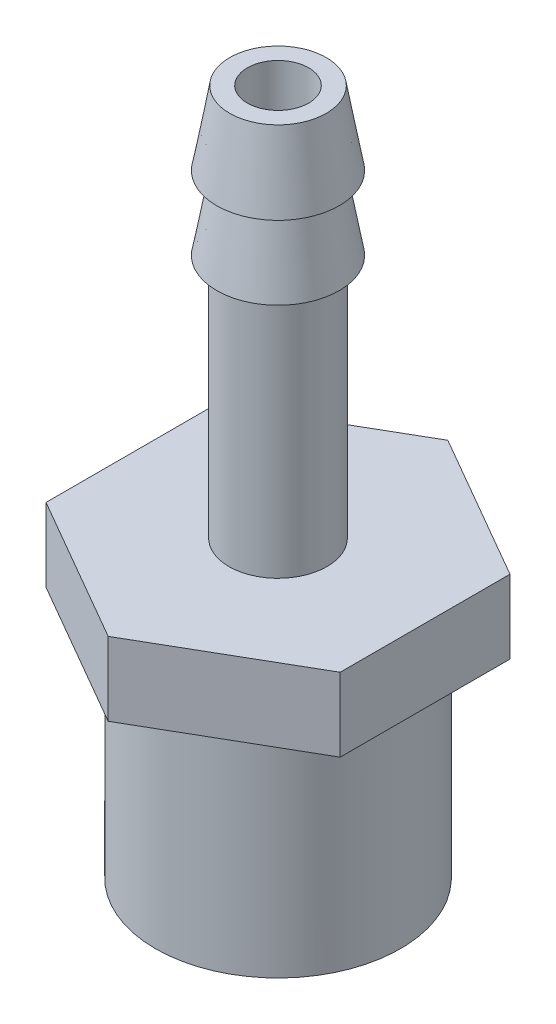
ISO-10303-21;
HEADER;
FILE_DESCRIPTION(('STEP AP214'),'2;1');
FILE_NAME('part.step','',(''),(''),'','','');
FILE_SCHEMA(('AUTOMOTIVE_DESIGN { 1 0 10303 214 1 1 1 1 }'));
ENDSEC;
DATA;
#1=APPLICATION_CONTEXT('core data for automotive mechanical design processes');
#2=APPLICATION_PROTOCOL_DEFINITION('international standard','automotive_design',2000,#1);
#3=PRODUCT_CONTEXT('',#1,'mechanical');
#4=PRODUCT('Part','Part','',(#3));
#5=PRODUCT_RELATED_PRODUCT_CATEGORY('part','',(#4));
#6=PRODUCT_DEFINITION_FORMATION('','',#4);
#7=PRODUCT_DEFINITION_CONTEXT('part definition',#1,'design');
#8=PRODUCT_DEFINITION('design','',#6,#7);
#9=PRODUCT_DEFINITION_SHAPE('','',#8);
#10=(LENGTH_UNIT() NAMED_UNIT(*) SI_UNIT(.MILLI.,.METRE.));
#11=(NAMED_UNIT(*) PLANE_ANGLE_UNIT() SI_UNIT($,.RADIAN.));
#12=(NAMED_UNIT(*) SI_UNIT($,.STERADIAN.) SOLID_ANGLE_UNIT());
#13=UNCERTAINTY_MEASURE_WITH_UNIT(LENGTH_MEASURE(1.E-05),#10,'distance_accuracy_value','');
#14=(GEOMETRIC_REPRESENTATION_CONTEXT(3) GLOBAL_UNCERTAINTY_ASSIGNED_CONTEXT((#13)) GLOBAL_UNIT_ASSIGNED_CONTEXT((#10,
#11,#12)) REPRESENTATION_CONTEXT('',''));
#15=CARTESIAN_POINT('',(0.,0.,0.));
#16=DIRECTION('',(0.,0.,1.));
#17=DIRECTION('',(1.,0.,0.));
#18=AXIS2_PLACEMENT_3D('',#15,#16,#17);
#19=CARTESIAN_POINT('',(0.,3.,-6.92820323027551));
#20=DIRECTION('',(0.,1.,0.));
#21=DIRECTION('',(0.,0.,1.));
#22=AXIS2_PLACEMENT_3D('',#19,#20,#21);
#23=PLANE('',#22);
#24=DIRECTION('',(-0.866025403784439,0.,-0.5));
#25=VECTOR('',#24,1.);
#26=CARTESIAN_POINT('',(6.,3.,-3.46410161513776));
#27=LINE('',#26,#25);
#28=CARTESIAN_POINT('',(6.,3.,-3.46410161513776));
#29=VERTEX_POINT('',#28);
#30=CARTESIAN_POINT('',(0.,3.,-6.92820323027551));
#31=VERTEX_POINT('',#30);
#32=EDGE_CURVE('E128',#29,#31,#27,.T.);
#33=ORIENTED_EDGE('',*,*,#32,.T.);
#34=DIRECTION('',(-0.866025403784438,0.,0.5));
#35=VECTOR('',#34,1.);
#36=CARTESIAN_POINT('',(0.,3.,-6.92820323027551));
#37=LINE('',#36,#35);
#38=CARTESIAN_POINT('',(-6.00000000000001,3.,-3.46410161513775));
#39=VERTEX_POINT('',#38);
#40=EDGE_CURVE('E86',#31,#39,#37,.T.);
#41=ORIENTED_EDGE('',*,*,#40,.T.);
#42=DIRECTION('',(0.,0.,1.));
#43=VECTOR('',#42,1.);
#44=CARTESIAN_POINT('',(-6.00000000000001,3.,-3.46410161513775));
#45=LINE('',#44,#43);
#46=CARTESIAN_POINT('',(-6.00000000000001,3.,3.46410161513776));
#47=VERTEX_POINT('',#46);
#48=EDGE_CURVE('E99',#39,#47,#45,.T.);
#49=ORIENTED_EDGE('',*,*,#48,.T.);
#50=DIRECTION('',(0.866025403784438,0.,0.5));
#51=VECTOR('',#50,1.);
#52=CARTESIAN_POINT('',(-6.00000000000001,3.,3.46410161513776));
#53=LINE('',#52,#51);
#54=CARTESIAN_POINT('',(0.,3.,6.92820323027551));
#55=VERTEX_POINT('',#54);
#56=EDGE_CURVE('E93',#47,#55,#53,.T.);
#57=ORIENTED_EDGE('',*,*,#56,.T.);
#58=DIRECTION('',(0.866025403784439,0.,-0.5));
#59=VECTOR('',#58,1.);
#60=CARTESIAN_POINT('',(0.,3.,6.92820323027551));
#61=LINE('',#60,#59);
#62=CARTESIAN_POINT('',(5.99999999999999,3.,3.46410161513776));
#63=VERTEX_POINT('',#62);
#64=EDGE_CURVE('E97',#55,#63,#61,.T.);
#65=ORIENTED_EDGE('',*,*,#64,.T.);
#66=DIRECTION('',(0.,0.,-1.));
#67=VECTOR('',#66,1.);
#68=CARTESIAN_POINT('',(5.99999999999999,3.,3.46410161513776));
#69=LINE('',#68,#67);
#70=EDGE_CURVE('E48',#63,#29,#69,.T.);
#71=ORIENTED_EDGE('',*,*,#70,.T.);
#72=EDGE_LOOP('',(#33,#41,#49,#57,#65,#71));
#73=FACE_BOUND('',#72,.T.);
#74=CARTESIAN_POINT('',(0.,3.,0.));
#75=DIRECTION('',(0.,1.,0.));
#76=DIRECTION('',(0.,0.,1.));
#77=AXIS2_PLACEMENT_3D('',#74,#75,#76);
#78=CIRCLE('',#77,2.);
#79=CARTESIAN_POINT('',(0.,3.,2.));
#80=VERTEX_POINT('',#79);
#81=EDGE_CURVE('E213',#80,#80,#78,.T.);
#82=ORIENTED_EDGE('',*,*,#81,.F.);
#83=EDGE_LOOP('',(#82));
#84=FACE_BOUND('',#83,.T.);
#85=ADVANCED_FACE('F31',(#73,#84),#23,.T.);
#86=CARTESIAN_POINT('',(0.,0.,-6.92820323027551));
#87=DIRECTION('',(0.,1.,0.));
#88=DIRECTION('',(0.,0.,1.));
#89=AXIS2_PLACEMENT_3D('',#86,#87,#88);
#90=PLANE('',#89);
#91=DIRECTION('',(-0.866025403784439,0.,-0.5));
#92=VECTOR('',#91,1.);
#93=CARTESIAN_POINT('',(6.,0.,-3.46410161513776));
#94=LINE('',#93,#92);
#95=CARTESIAN_POINT('',(6.,0.,-3.46410161513776));
#96=VERTEX_POINT('',#95);
#97=CARTESIAN_POINT('',(0.,0.,-6.92820323027551));
#98=VERTEX_POINT('',#97);
#99=EDGE_CURVE('E117',#96,#98,#94,.T.);
#100=ORIENTED_EDGE('',*,*,#99,.F.);
#101=DIRECTION('',(0.,0.,-1.));
#102=VECTOR('',#101,1.);
#103=CARTESIAN_POINT('',(5.99999999999999,0.,3.46410161513776));
#104=LINE('',#103,#102);
#105=CARTESIAN_POINT('',(5.99999999999999,0.,3.46410161513776));
#106=VERTEX_POINT('',#105);
#107=EDGE_CURVE('E77',#106,#96,#104,.T.);
#108=ORIENTED_EDGE('',*,*,#107,.F.);
#109=DIRECTION('',(0.866025403784439,0.,-0.5));
#110=VECTOR('',#109,1.);
#111=CARTESIAN_POINT('',(0.,0.,6.92820323027551));
#112=LINE('',#111,#110);
#113=CARTESIAN_POINT('',(0.,0.,6.92820323027551));
#114=VERTEX_POINT('',#113);
#115=EDGE_CURVE('E71',#114,#106,#112,.T.);
#116=ORIENTED_EDGE('',*,*,#115,.F.);
#117=DIRECTION('',(0.866025403784438,0.,0.5));
#118=VECTOR('',#117,1.);
#119=CARTESIAN_POINT('',(-6.00000000000001,0.,3.46410161513776));
#120=LINE('',#119,#118);
#121=CARTESIAN_POINT('',(-6.00000000000001,0.,3.46410161513776));
#122=VERTEX_POINT('',#121);
#123=EDGE_CURVE('E107',#122,#114,#120,.T.);
#124=ORIENTED_EDGE('',*,*,#123,.F.);
#125=DIRECTION('',(0.,0.,1.));
#126=VECTOR('',#125,1.);
#127=CARTESIAN_POINT('',(-6.00000000000001,0.,-3.46410161513775));
#128=LINE('',#127,#126);
#129=CARTESIAN_POINT('',(-6.00000000000001,0.,-3.46410161513775));
#130=VERTEX_POINT('',#129);
#131=EDGE_CURVE('E123',#130,#122,#128,.T.);
#132=ORIENTED_EDGE('',*,*,#131,.F.);
#133=DIRECTION('',(-0.866025403784438,0.,0.5));
#134=VECTOR('',#133,1.);
#135=CARTESIAN_POINT('',(0.,0.,-6.92820323027551));
#136=LINE('',#135,#134);
#137=EDGE_CURVE('E120',#98,#130,#136,.T.);
#138=ORIENTED_EDGE('',*,*,#137,.F.);
#139=EDGE_LOOP('',(#100,#108,#116,#124,#132,#138));
#140=FACE_BOUND('',#139,.T.);
#141=CARTESIAN_POINT('',(0.,0.,0.));
#142=DIRECTION('',(0.,1.,0.));
#143=DIRECTION('',(0.,0.,1.));
#144=AXIS2_PLACEMENT_3D('',#141,#142,#143);
#145=CIRCLE('',#144,5.);
#146=CARTESIAN_POINT('',(0.,0.,5.));
#147=VERTEX_POINT('',#146);
#148=EDGE_CURVE('E137',#147,#147,#145,.F.);
#149=ORIENTED_EDGE('',*,*,#148,.F.);
#150=EDGE_LOOP('',(#149));
#151=FACE_BOUND('',#150,.T.);
#152=ADVANCED_FACE('F162',(#140,#151),#90,.F.);
#153=CARTESIAN_POINT('',(6.,3.,-3.46410161513776));
#154=DIRECTION('',(-0.5,0.,0.866025403784438));
#155=DIRECTION('',(0.866025403784439,0.,0.5));
#156=AXIS2_PLACEMENT_3D('',#153,#154,#155);
#157=PLANE('',#156);
#158=ORIENTED_EDGE('',*,*,#99,.T.);
#159=DIRECTION('',(0.,-1.,0.));
#160=VECTOR('',#159,1.);
#161=CARTESIAN_POINT('',(0.,3.,-6.92820323027551));
#162=LINE('',#161,#160);
#163=EDGE_CURVE('E135',#31,#98,#162,.T.);
#164=ORIENTED_EDGE('',*,*,#163,.F.);
#165=ORIENTED_EDGE('',*,*,#32,.F.);
#166=DIRECTION('',(0.,-1.,0.));
#167=VECTOR('',#166,1.);
#168=CARTESIAN_POINT('',(6.,3.,-3.46410161513776));
#169=LINE('',#168,#167);
#170=EDGE_CURVE('E113',#29,#96,#169,.T.);
#171=ORIENTED_EDGE('',*,*,#170,.T.);
#172=EDGE_LOOP('',(#158,#164,#165,#171));
#173=FACE_BOUND('',#172,.T.);
#174=ADVANCED_FACE('F167',(#173),#157,.F.);
#175=CARTESIAN_POINT('',(0.,3.,-6.92820323027551));
#176=DIRECTION('',(0.5,0.,0.866025403784439));
#177=DIRECTION('',(0.866025403784439,0.,-0.5));
#178=AXIS2_PLACEMENT_3D('',#175,#176,#177);
#179=PLANE('',#178);
#180=ORIENTED_EDGE('',*,*,#137,.T.);
#181=DIRECTION('',(0.,-1.,0.));
#182=VECTOR('',#181,1.);
#183=CARTESIAN_POINT('',(-6.00000000000001,3.,-3.46410161513775));
#184=LINE('',#183,#182);
#185=EDGE_CURVE('E132',#39,#130,#184,.T.);
#186=ORIENTED_EDGE('',*,*,#185,.F.);
#187=ORIENTED_EDGE('',*,*,#40,.F.);
#188=ORIENTED_EDGE('',*,*,#163,.T.);
#189=EDGE_LOOP('',(#180,#186,#187,#188));
#190=FACE_BOUND('',#189,.T.);
#191=ADVANCED_FACE('F189',(#190),#179,.F.);
#192=CARTESIAN_POINT('',(-6.00000000000001,3.,-3.46410161513775));
#193=DIRECTION('',(1.,0.,0.));
#194=DIRECTION('',(0.,0.,-1.));
#195=AXIS2_PLACEMENT_3D('',#192,#193,#194);
#196=PLANE('',#195);
#197=ORIENTED_EDGE('',*,*,#131,.T.);
#198=DIRECTION('',(0.,-1.,0.));
#199=VECTOR('',#198,1.);
#200=CARTESIAN_POINT('',(-6.00000000000001,3.,3.46410161513776));
#201=LINE('',#200,#199);
#202=EDGE_CURVE('E108',#47,#122,#201,.T.);
#203=ORIENTED_EDGE('',*,*,#202,.F.);
#204=ORIENTED_EDGE('',*,*,#48,.F.);
#205=ORIENTED_EDGE('',*,*,#185,.T.);
#206=EDGE_LOOP('',(#197,#203,#204,#205));
#207=FACE_BOUND('',#206,.T.);
#208=ADVANCED_FACE('F186',(#207),#196,.F.);
#209=CARTESIAN_POINT('',(-6.00000000000001,3.,3.46410161513776));
#210=DIRECTION('',(0.5,0.,-0.866025403784439));
#211=DIRECTION('',(-0.866025403784439,0.,-0.5));
#212=AXIS2_PLACEMENT_3D('',#209,#210,#211);
#213=PLANE('',#212);
#214=ORIENTED_EDGE('',*,*,#123,.T.);
#215=DIRECTION('',(0.,-1.,0.));
#216=VECTOR('',#215,1.);
#217=CARTESIAN_POINT('',(0.,3.,6.92820323027551));
#218=LINE('',#217,#216);
#219=EDGE_CURVE('E104',#55,#114,#218,.T.);
#220=ORIENTED_EDGE('',*,*,#219,.F.);
#221=ORIENTED_EDGE('',*,*,#56,.F.);
#222=ORIENTED_EDGE('',*,*,#202,.T.);
#223=EDGE_LOOP('',(#214,#220,#221,#222));
#224=FACE_BOUND('',#223,.T.);
#225=ADVANCED_FACE('F105',(#224),#213,.F.);
#226=CARTESIAN_POINT('',(0.,3.,6.92820323027551));
#227=DIRECTION('',(-0.5,0.,-0.866025403784439));
#228=DIRECTION('',(-0.866025403784439,0.,0.5));
#229=AXIS2_PLACEMENT_3D('',#226,#227,#228);
#230=PLANE('',#229);
#231=ORIENTED_EDGE('',*,*,#115,.T.);
#232=DIRECTION('',(0.,-1.,0.));
#233=VECTOR('',#232,1.);
#234=CARTESIAN_POINT('',(5.99999999999999,3.,3.46410161513776));
#235=LINE('',#234,#233);
#236=EDGE_CURVE('E109',#63,#106,#235,.T.);
#237=ORIENTED_EDGE('',*,*,#236,.F.);
#238=ORIENTED_EDGE('',*,*,#64,.F.);
#239=ORIENTED_EDGE('',*,*,#219,.T.);
#240=EDGE_LOOP('',(#231,#237,#238,#239));
#241=FACE_BOUND('',#240,.T.);
#242=ADVANCED_FACE('F111',(#241),#230,.F.);
#243=CARTESIAN_POINT('',(5.99999999999999,3.,3.46410161513776));
#244=DIRECTION('',(-1.,0.,0.));
#245=DIRECTION('',(0.,0.,1.));
#246=AXIS2_PLACEMENT_3D('',#243,#244,#245);
#247=PLANE('',#246);
#248=ORIENTED_EDGE('',*,*,#107,.T.);
#249=ORIENTED_EDGE('',*,*,#170,.F.);
#250=ORIENTED_EDGE('',*,*,#70,.F.);
#251=ORIENTED_EDGE('',*,*,#236,.T.);
#252=EDGE_LOOP('',(#248,#249,#250,#251));
#253=FACE_BOUND('',#252,.T.);
#254=ADVANCED_FACE('F178',(#253),#247,.F.);
#255=CARTESIAN_POINT('',(0.,-9.,0.));
#256=DIRECTION('',(0.,-1.,0.));
#257=DIRECTION('',(0.,0.,-1.));
#258=AXIS2_PLACEMENT_3D('',#255,#256,#257);
#259=PLANE('',#258);
#260=CARTESIAN_POINT('',(0.,-9.,0.));
#261=DIRECTION('',(0.,-1.,0.));
#262=DIRECTION('',(0.,0.,-1.));
#263=AXIS2_PLACEMENT_3D('',#260,#261,#262);
#264=CIRCLE('',#263,5.);
#265=CARTESIAN_POINT('',(0.,-9.,-5.));
#266=VERTEX_POINT('',#265);
#267=EDGE_CURVE('E121',#266,#266,#264,.T.);
#268=ORIENTED_EDGE('',*,*,#267,.T.);
#269=EDGE_LOOP('',(#268));
#270=FACE_BOUND('',#269,.T.);
#271=CARTESIAN_POINT('',(0.,-9.,0.));
#272=DIRECTION('',(0.,-1.,0.));
#273=DIRECTION('',(0.,0.,-1.));
#274=AXIS2_PLACEMENT_3D('',#271,#272,#273);
#275=CIRCLE('',#274,3.5);
#276=CARTESIAN_POINT('',(0.,-9.,-3.5));
#277=VERTEX_POINT('',#276);
#278=EDGE_CURVE('E206',#277,#277,#275,.T.);
#279=ORIENTED_EDGE('',*,*,#278,.F.);
#280=EDGE_LOOP('',(#279));
#281=FACE_BOUND('',#280,.T.);
#282=ADVANCED_FACE('F181',(#270,#281),#259,.T.);
#283=CARTESIAN_POINT('',(0.,-9.,0.));
#284=DIRECTION('',(0.,1.,0.));
#285=DIRECTION('',(0.,0.,1.));
#286=AXIS2_PLACEMENT_3D('',#283,#284,#285);
#287=CYLINDRICAL_SURFACE('',#286,5.);
#288=ORIENTED_EDGE('',*,*,#267,.F.);
#289=EDGE_LOOP('',(#288));
#290=FACE_BOUND('',#289,.T.);
#291=ORIENTED_EDGE('',*,*,#148,.T.);
#292=EDGE_LOOP('',(#291));
#293=FACE_BOUND('',#292,.T.);
#294=ADVANCED_FACE('F172',(#290,#293),#287,.T.);
#295=CARTESIAN_POINT('',(0.,-9.,0.));
#296=DIRECTION('',(0.,1.,0.));
#297=DIRECTION('',(0.,0.,1.));
#298=AXIS2_PLACEMENT_3D('',#295,#296,#297);
#299=CYLINDRICAL_SURFACE('',#298,3.5);
#300=ORIENTED_EDGE('',*,*,#278,.T.);
#301=EDGE_LOOP('',(#300));
#302=FACE_BOUND('',#301,.T.);
#303=CARTESIAN_POINT('',(0.,0.,0.));
#304=DIRECTION('',(0.,-1.,0.));
#305=DIRECTION('',(0.,0.,-1.));
#306=AXIS2_PLACEMENT_3D('',#303,#304,#305);
#307=CIRCLE('',#306,3.5);
#308=CARTESIAN_POINT('',(0.,0.,-3.5));
#309=VERTEX_POINT('',#308);
#310=EDGE_CURVE('E207',#309,#309,#307,.T.);
#311=ORIENTED_EDGE('',*,*,#310,.F.);
#312=EDGE_LOOP('',(#311));
#313=FACE_BOUND('',#312,.T.);
#314=ADVANCED_FACE('F176',(#302,#313),#299,.F.);
#315=CARTESIAN_POINT('',(0.,0.,0.));
#316=DIRECTION('',(0.,1.,0.));
#317=DIRECTION('',(0.,0.,1.));
#318=AXIS2_PLACEMENT_3D('',#315,#316,#317);
#319=CIRCLE('',#318,1.25);
#320=CARTESIAN_POINT('',(0.,0.,1.25));
#321=VERTEX_POINT('',#320);
#322=EDGE_CURVE('E223',#321,#321,#319,.F.);
#323=ORIENTED_EDGE('',*,*,#322,.F.);
#324=EDGE_LOOP('',(#323));
#325=FACE_BOUND('',#324,.T.);
#326=ORIENTED_EDGE('',*,*,#310,.T.);
#327=EDGE_LOOP('',(#326));
#328=FACE_BOUND('',#327,.T.);
#329=ADVANCED_FACE('F170',(#325,#328),#90,.F.);
#330=CARTESIAN_POINT('',(0.,13.,0.));
#331=DIRECTION('',(0.,-1.,0.));
#332=DIRECTION('',(0.,0.,-1.));
#333=AXIS2_PLACEMENT_3D('',#330,#331,#332);
#334=CYLINDRICAL_SURFACE('',#333,2.);
#335=CARTESIAN_POINT('',(0.,13.,0.));
#336=DIRECTION('',(0.,1.,0.));
#337=DIRECTION('',(0.,0.,1.));
#338=AXIS2_PLACEMENT_3D('',#335,#336,#337);
#339=CIRCLE('',#338,2.);
#340=CARTESIAN_POINT('',(0.,13.,2.));
#341=VERTEX_POINT('',#340);
#342=EDGE_CURVE('E210',#341,#341,#339,.T.);
#343=ORIENTED_EDGE('',*,*,#342,.F.);
#344=EDGE_LOOP('',(#343));
#345=FACE_BOUND('',#344,.T.);
#346=ORIENTED_EDGE('',*,*,#81,.T.);
#347=EDGE_LOOP('',(#346));
#348=FACE_BOUND('',#347,.T.);
#349=ADVANCED_FACE('F156',(#345,#348),#334,.T.);
#350=CARTESIAN_POINT('',(0.,13.,0.));
#351=DIRECTION('',(0.,1.,0.));
#352=DIRECTION('',(0.,0.,1.));
#353=AXIS2_PLACEMENT_3D('',#350,#351,#352);
#354=PLANE('',#353);
#355=CARTESIAN_POINT('',(0.,13.,0.));
#356=DIRECTION('',(0.,1.,0.));
#357=DIRECTION('',(0.,0.,1.));
#358=AXIS2_PLACEMENT_3D('',#355,#356,#357);
#359=CIRCLE('',#358,2.5);
#360=CARTESIAN_POINT('',(0.,13.,2.5));
#361=VERTEX_POINT('',#360);
#362=EDGE_CURVE('E216',#361,#361,#359,.T.);
#363=ORIENTED_EDGE('',*,*,#362,.F.);
#364=EDGE_LOOP('',(#363));
#365=FACE_BOUND('',#364,.T.);
#366=ORIENTED_EDGE('',*,*,#342,.T.);
#367=EDGE_LOOP('',(#366));
#368=FACE_BOUND('',#367,.T.);
#369=ADVANCED_FACE('F148',(#365,#368),#354,.F.);
#370=CARTESIAN_POINT('',(0.,16.,0.));
#371=DIRECTION('',(0.,-1.,0.));
#372=DIRECTION('',(0.,0.,-1.));
#373=AXIS2_PLACEMENT_3D('',#370,#371,#372);
#374=CONICAL_SURFACE('',#373,1.9710190578746,0.17453292519943);
#375=ORIENTED_EDGE('',*,*,#362,.T.);
#376=EDGE_LOOP('',(#375));
#377=FACE_BOUND('',#376,.T.);
#378=CARTESIAN_POINT('',(0.,16.,0.));
#379=DIRECTION('',(0.,1.,0.));
#380=DIRECTION('',(0.,0.,1.));
#381=AXIS2_PLACEMENT_3D('',#378,#379,#380);
#382=CIRCLE('',#381,1.9710190578746);
#383=CARTESIAN_POINT('',(0.,16.,1.9710190578746));
#384=VERTEX_POINT('',#383);
#385=EDGE_CURVE('E40',#384,#384,#382,.T.);
#386=ORIENTED_EDGE('',*,*,#385,.F.);
#387=EDGE_LOOP('',(#386));
#388=FACE_BOUND('',#387,.T.);
#389=ADVANCED_FACE('F145',(#377,#388),#374,.T.);
#390=CARTESIAN_POINT('',(0.,19.,0.));
#391=DIRECTION('',(0.,1.,0.));
#392=DIRECTION('',(0.,0.,1.));
#393=AXIS2_PLACEMENT_3D('',#390,#391,#392);
#394=PLANE('',#393);
#395=CARTESIAN_POINT('',(0.,19.,0.));
#396=DIRECTION('',(0.,1.,0.));
#397=DIRECTION('',(0.,0.,1.));
#398=AXIS2_PLACEMENT_3D('',#395,#396,#397);
#399=CIRCLE('',#398,1.25);
#400=CARTESIAN_POINT('',(0.,19.,1.25));
#401=VERTEX_POINT('',#400);
#402=EDGE_CURVE('E226',#401,#401,#399,.T.);
#403=ORIENTED_EDGE('',*,*,#402,.F.);
#404=EDGE_LOOP('',(#403));
#405=FACE_BOUND('',#404,.T.);
#406=CARTESIAN_POINT('',(0.,19.,0.));
#407=DIRECTION('',(0.,1.,0.));
#408=DIRECTION('',(0.,0.,1.));
#409=AXIS2_PLACEMENT_3D('',#406,#407,#408);
#410=CIRCLE('',#409,1.97101905787461);
#411=CARTESIAN_POINT('',(0.,19.,1.97101905787461));
#412=VERTEX_POINT('',#411);
#413=EDGE_CURVE('E11',#412,#412,#410,.T.);
#414=ORIENTED_EDGE('',*,*,#413,.T.);
#415=EDGE_LOOP('',(#414));
#416=FACE_BOUND('',#415,.T.);
#417=ADVANCED_FACE('F147',(#405,#416),#394,.T.);
#418=CARTESIAN_POINT('',(0.,16.,0.));
#419=DIRECTION('',(0.,1.,0.));
#420=DIRECTION('',(0.,0.,1.));
#421=AXIS2_PLACEMENT_3D('',#418,#419,#420);
#422=PLANE('',#421);
#423=ORIENTED_EDGE('',*,*,#385,.T.);
#424=EDGE_LOOP('',(#423));
#425=FACE_BOUND('',#424,.T.);
#426=CARTESIAN_POINT('',(0.,16.,0.));
#427=DIRECTION('',(0.,1.,0.));
#428=DIRECTION('',(0.,0.,1.));
#429=AXIS2_PLACEMENT_3D('',#426,#427,#428);
#430=CIRCLE('',#429,2.5);
#431=CARTESIAN_POINT('',(0.,16.,2.5));
#432=VERTEX_POINT('',#431);
#433=EDGE_CURVE('E220',#432,#432,#430,.T.);
#434=ORIENTED_EDGE('',*,*,#433,.F.);
#435=EDGE_LOOP('',(#434));
#436=FACE_BOUND('',#435,.T.);
#437=ADVANCED_FACE('F142',(#425,#436),#422,.F.);
#438=CARTESIAN_POINT('',(0.,19.,0.));
#439=DIRECTION('',(0.,-1.,0.));
#440=DIRECTION('',(0.,0.,-1.));
#441=AXIS2_PLACEMENT_3D('',#438,#439,#440);
#442=CONICAL_SURFACE('',#441,1.97101905787461,0.174532925199431);
#443=ORIENTED_EDGE('',*,*,#433,.T.);
#444=EDGE_LOOP('',(#443));
#445=FACE_BOUND('',#444,.T.);
#446=ORIENTED_EDGE('',*,*,#413,.F.);
#447=EDGE_LOOP('',(#446));
#448=FACE_BOUND('',#447,.T.);
#449=ADVANCED_FACE('F33',(#445,#448),#442,.T.);
#450=CARTESIAN_POINT('',(0.,-9.001,0.));
#451=DIRECTION('',(0.,1.,0.));
#452=DIRECTION('',(0.,0.,1.));
#453=AXIS2_PLACEMENT_3D('',#450,#451,#452);
#454=CYLINDRICAL_SURFACE('',#453,1.25);
#455=ORIENTED_EDGE('',*,*,#402,.T.);
#456=EDGE_LOOP('',(#455));
#457=FACE_BOUND('',#456,.T.);
#458=ORIENTED_EDGE('',*,*,#322,.T.);
#459=EDGE_LOOP('',(#458));
#460=FACE_BOUND('',#459,.T.);
#461=ADVANCED_FACE('F230',(#457,#460),#454,.F.);
#462=CLOSED_SHELL('',(#85,#152,#174,#191,#208,#225,#242,#254,#282,#294,#314,#329,#349,#369,#389,
#417,#437,#449,#461));
#463=MANIFOLD_SOLID_BREP('B2',#462);
#464=ADVANCED_BREP_SHAPE_REPRESENTATION('',(#18,#463),#14);
#465=SHAPE_DEFINITION_REPRESENTATION(#9,#464);
ENDSEC;
END-ISO-10303-21;
